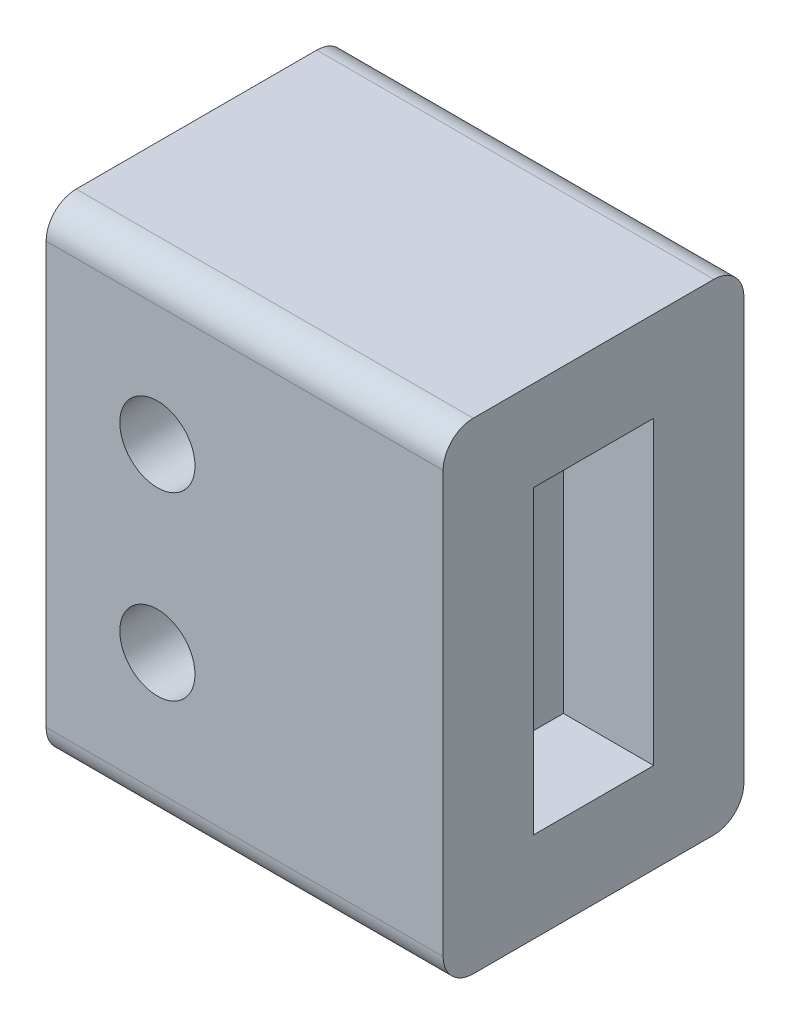
ISO-10303-21;
HEADER;
FILE_DESCRIPTION(('STEP AP214'),'2;1');
FILE_NAME('part.step','',(''),(''),'','','');
FILE_SCHEMA(('AUTOMOTIVE_DESIGN { 1 0 10303 214 1 1 1 1 }'));
ENDSEC;
DATA;
#1=APPLICATION_CONTEXT('core data for automotive mechanical design processes');
#2=APPLICATION_PROTOCOL_DEFINITION('international standard','automotive_design',2000,#1);
#3=PRODUCT_CONTEXT('',#1,'mechanical');
#4=PRODUCT('Part','Part','',(#3));
#5=PRODUCT_RELATED_PRODUCT_CATEGORY('part','',(#4));
#6=PRODUCT_DEFINITION_FORMATION('','',#4);
#7=PRODUCT_DEFINITION_CONTEXT('part definition',#1,'design');
#8=PRODUCT_DEFINITION('design','',#6,#7);
#9=PRODUCT_DEFINITION_SHAPE('','',#8);
#10=(LENGTH_UNIT() NAMED_UNIT(*) SI_UNIT(.MILLI.,.METRE.));
#11=(NAMED_UNIT(*) PLANE_ANGLE_UNIT() SI_UNIT($,.RADIAN.));
#12=(NAMED_UNIT(*) SI_UNIT($,.STERADIAN.) SOLID_ANGLE_UNIT());
#13=UNCERTAINTY_MEASURE_WITH_UNIT(LENGTH_MEASURE(1.E-05),#10,'distance_accuracy_value','');
#14=(GEOMETRIC_REPRESENTATION_CONTEXT(3) GLOBAL_UNCERTAINTY_ASSIGNED_CONTEXT((#13)) GLOBAL_UNIT_ASSIGNED_CONTEXT((#10,
#11,#12)) REPRESENTATION_CONTEXT('',''));
#15=CARTESIAN_POINT('',(0.,0.,0.));
#16=DIRECTION('',(0.,0.,1.));
#17=DIRECTION('',(1.,0.,0.));
#18=AXIS2_PLACEMENT_3D('',#15,#16,#17);
#19=CARTESIAN_POINT('',(16.3,6.,6.));
#20=DIRECTION('',(1.,0.,0.));
#21=DIRECTION('',(0.,0.,-1.));
#22=AXIS2_PLACEMENT_3D('',#19,#20,#21);
#23=PLANE('',#22);
#24=DIRECTION('',(0.,-1.,0.));
#25=VECTOR('',#24,1.);
#26=CARTESIAN_POINT('',(16.3,6.,-2.));
#27=LINE('',#26,#25);
#28=CARTESIAN_POINT('',(16.3,7.,-2.));
#29=VERTEX_POINT('',#28);
#30=CARTESIAN_POINT('',(16.3,-7.,-2.));
#31=VERTEX_POINT('',#30);
#32=EDGE_CURVE('E255',#29,#31,#27,.T.);
#33=ORIENTED_EDGE('',*,*,#32,.T.);
#34=CARTESIAN_POINT('',(16.3,-7.,-1.));
#35=DIRECTION('',(1.,0.,0.));
#36=DIRECTION('',(0.,0.,-1.));
#37=AXIS2_PLACEMENT_3D('',#34,#35,#36);
#38=CIRCLE('',#37,1.);
#39=CARTESIAN_POINT('',(16.3,-8.,-1.));
#40=VERTEX_POINT('',#39);
#41=EDGE_CURVE('E291',#31,#40,#38,.F.);
#42=ORIENTED_EDGE('',*,*,#41,.T.);
#43=DIRECTION('',(0.,0.,-1.));
#44=VECTOR('',#43,1.);
#45=CARTESIAN_POINT('',(16.3,-8.,6.));
#46=LINE('',#45,#44);
#47=CARTESIAN_POINT('',(16.3,-8.,7.));
#48=VERTEX_POINT('',#47);
#49=EDGE_CURVE('E259',#48,#40,#46,.T.);
#50=ORIENTED_EDGE('',*,*,#49,.F.);
#51=CARTESIAN_POINT('',(16.3,-7.,7.));
#52=DIRECTION('',(1.,0.,0.));
#53=DIRECTION('',(0.,0.,-1.));
#54=AXIS2_PLACEMENT_3D('',#51,#52,#53);
#55=CIRCLE('',#54,1.);
#56=CARTESIAN_POINT('',(16.3,-7.,8.));
#57=VERTEX_POINT('',#56);
#58=EDGE_CURVE('E289',#48,#57,#55,.F.);
#59=ORIENTED_EDGE('',*,*,#58,.T.);
#60=DIRECTION('',(0.,-1.,0.));
#61=VECTOR('',#60,1.);
#62=CARTESIAN_POINT('',(16.3,6.,8.));
#63=LINE('',#62,#61);
#64=CARTESIAN_POINT('',(16.3,7.,8.));
#65=VERTEX_POINT('',#64);
#66=EDGE_CURVE('E262',#65,#57,#63,.T.);
#67=ORIENTED_EDGE('',*,*,#66,.F.);
#68=CARTESIAN_POINT('',(16.3,7.,7.));
#69=DIRECTION('',(1.,0.,0.));
#70=DIRECTION('',(0.,0.,-1.));
#71=AXIS2_PLACEMENT_3D('',#68,#69,#70);
#72=CIRCLE('',#71,1.);
#73=CARTESIAN_POINT('',(16.3,8.,7.));
#74=VERTEX_POINT('',#73);
#75=EDGE_CURVE('E59',#65,#74,#72,.F.);
#76=ORIENTED_EDGE('',*,*,#75,.T.);
#77=DIRECTION('',(0.,0.,-1.));
#78=VECTOR('',#77,1.);
#79=CARTESIAN_POINT('',(16.3,8.,6.));
#80=LINE('',#79,#78);
#81=CARTESIAN_POINT('',(16.3,8.,-1.));
#82=VERTEX_POINT('',#81);
#83=EDGE_CURVE('E256',#74,#82,#80,.T.);
#84=ORIENTED_EDGE('',*,*,#83,.T.);
#85=CARTESIAN_POINT('',(16.3,7.,-1.));
#86=DIRECTION('',(1.,0.,0.));
#87=DIRECTION('',(0.,0.,-1.));
#88=AXIS2_PLACEMENT_3D('',#85,#86,#87);
#89=CIRCLE('',#88,1.);
#90=EDGE_CURVE('E51',#82,#29,#89,.F.);
#91=ORIENTED_EDGE('',*,*,#90,.T.);
#92=EDGE_LOOP('',(#33,#42,#50,#59,#67,#76,#84,#91));
#93=FACE_BOUND('',#92,.T.);
#94=DIRECTION('',(0.,-1.,0.));
#95=VECTOR('',#94,1.);
#96=CARTESIAN_POINT('',(16.3,6.,0.));
#97=LINE('',#96,#95);
#98=CARTESIAN_POINT('',(16.3,6.,0.));
#99=VERTEX_POINT('',#98);
#100=CARTESIAN_POINT('',(16.3,-6.,0.));
#101=VERTEX_POINT('',#100);
#102=EDGE_CURVE('E241',#99,#101,#97,.T.);
#103=ORIENTED_EDGE('',*,*,#102,.F.);
#104=DIRECTION('',(0.,0.,-1.));
#105=VECTOR('',#104,1.);
#106=CARTESIAN_POINT('',(16.3,6.,6.));
#107=LINE('',#106,#105);
#108=CARTESIAN_POINT('',(16.3,6.,6.));
#109=VERTEX_POINT('',#108);
#110=EDGE_CURVE('E249',#109,#99,#107,.T.);
#111=ORIENTED_EDGE('',*,*,#110,.F.);
#112=DIRECTION('',(0.,-1.,0.));
#113=VECTOR('',#112,1.);
#114=CARTESIAN_POINT('',(16.3,6.,6.));
#115=LINE('',#114,#113);
#116=CARTESIAN_POINT('',(16.3,-6.,6.));
#117=VERTEX_POINT('',#116);
#118=EDGE_CURVE('E231',#109,#117,#115,.T.);
#119=ORIENTED_EDGE('',*,*,#118,.T.);
#120=DIRECTION('',(0.,0.,-1.));
#121=VECTOR('',#120,1.);
#122=CARTESIAN_POINT('',(16.3,-6.,6.));
#123=LINE('',#122,#121);
#124=EDGE_CURVE('E246',#117,#101,#123,.T.);
#125=ORIENTED_EDGE('',*,*,#124,.T.);
#126=EDGE_LOOP('',(#103,#111,#119,#125));
#127=FACE_BOUND('',#126,.T.);
#128=ADVANCED_FACE('F36',(#93,#127),#23,.F.);
#129=CARTESIAN_POINT('',(23.5,8.,6.));
#130=DIRECTION('',(0.,-1.,0.));
#131=DIRECTION('',(1.,0.,0.));
#132=AXIS2_PLACEMENT_3D('',#129,#130,#131);
#133=PLANE('',#132);
#134=ORIENTED_EDGE('',*,*,#83,.F.);
#135=DIRECTION('',(-1.,0.,0.));
#136=VECTOR('',#135,1.);
#137=CARTESIAN_POINT('',(29.5,8.,7.));
#138=LINE('',#137,#136);
#139=CARTESIAN_POINT('',(29.5,8.,7.));
#140=VERTEX_POINT('',#139);
#141=EDGE_CURVE('E11',#74,#140,#138,.F.);
#142=ORIENTED_EDGE('',*,*,#141,.T.);
#143=DIRECTION('',(0.,0.,1.));
#144=VECTOR('',#143,1.);
#145=CARTESIAN_POINT('',(29.5,8.,8.));
#146=LINE('',#145,#144);
#147=CARTESIAN_POINT('',(29.5,8.,-1.));
#148=VERTEX_POINT('',#147);
#149=EDGE_CURVE('E200',#148,#140,#146,.T.);
#150=ORIENTED_EDGE('',*,*,#149,.F.);
#151=DIRECTION('',(-1.,0.,0.));
#152=VECTOR('',#151,1.);
#153=CARTESIAN_POINT('',(23.5,8.,-1.));
#154=LINE('',#153,#152);
#155=EDGE_CURVE('E44',#148,#82,#154,.T.);
#156=ORIENTED_EDGE('',*,*,#155,.T.);
#157=EDGE_LOOP('',(#134,#142,#150,#156));
#158=FACE_BOUND('',#157,.T.);
#159=ADVANCED_FACE('F300',(#158),#133,.F.);
#160=CARTESIAN_POINT('',(16.3,-8.,6.));
#161=DIRECTION('',(0.,1.,0.));
#162=DIRECTION('',(-1.,0.,0.));
#163=AXIS2_PLACEMENT_3D('',#160,#161,#162);
#164=PLANE('',#163);
#165=ORIENTED_EDGE('',*,*,#49,.T.);
#166=DIRECTION('',(1.,0.,0.));
#167=VECTOR('',#166,1.);
#168=CARTESIAN_POINT('',(16.3,-8.,-1.));
#169=LINE('',#168,#167);
#170=CARTESIAN_POINT('',(29.5,-8.,-1.));
#171=VERTEX_POINT('',#170);
#172=EDGE_CURVE('E272',#40,#171,#169,.T.);
#173=ORIENTED_EDGE('',*,*,#172,.T.);
#174=DIRECTION('',(0.,0.,-1.));
#175=VECTOR('',#174,1.);
#176=CARTESIAN_POINT('',(29.5,-8.,8.));
#177=LINE('',#176,#175);
#178=CARTESIAN_POINT('',(29.5,-8.,7.));
#179=VERTEX_POINT('',#178);
#180=EDGE_CURVE('E194',#179,#171,#177,.T.);
#181=ORIENTED_EDGE('',*,*,#180,.F.);
#182=DIRECTION('',(1.,0.,0.));
#183=VECTOR('',#182,1.);
#184=CARTESIAN_POINT('',(16.3,-8.,7.));
#185=LINE('',#184,#183);
#186=EDGE_CURVE('E258',#179,#48,#185,.F.);
#187=ORIENTED_EDGE('',*,*,#186,.T.);
#188=EDGE_LOOP('',(#165,#173,#181,#187));
#189=FACE_BOUND('',#188,.T.);
#190=ADVANCED_FACE('F317',(#189),#164,.F.);
#191=CARTESIAN_POINT('',(0.,0.,8.));
#192=DIRECTION('',(0.,0.,1.));
#193=DIRECTION('',(1.,0.,0.));
#194=AXIS2_PLACEMENT_3D('',#191,#192,#193);
#195=PLANE('',#194);
#196=CARTESIAN_POINT('',(20.,-3.,8.));
#197=DIRECTION('',(0.,0.,1.));
#198=DIRECTION('',(1.,0.,0.));
#199=AXIS2_PLACEMENT_3D('',#196,#197,#198);
#200=CIRCLE('',#199,1.25);
#201=CARTESIAN_POINT('',(21.25,-3.,8.));
#202=VERTEX_POINT('',#201);
#203=EDGE_CURVE('E204',#202,#202,#200,.T.);
#204=ORIENTED_EDGE('',*,*,#203,.F.);
#205=EDGE_LOOP('',(#204));
#206=FACE_BOUND('',#205,.T.);
#207=CARTESIAN_POINT('',(20.,3.,8.));
#208=DIRECTION('',(0.,0.,1.));
#209=DIRECTION('',(1.,0.,0.));
#210=AXIS2_PLACEMENT_3D('',#207,#208,#209);
#211=CIRCLE('',#210,1.25);
#212=CARTESIAN_POINT('',(21.25,3.,8.));
#213=VERTEX_POINT('',#212);
#214=EDGE_CURVE('E203',#213,#213,#211,.T.);
#215=ORIENTED_EDGE('',*,*,#214,.F.);
#216=EDGE_LOOP('',(#215));
#217=FACE_BOUND('',#216,.T.);
#218=ORIENTED_EDGE('',*,*,#66,.T.);
#219=DIRECTION('',(1.,0.,0.));
#220=VECTOR('',#219,1.);
#221=CARTESIAN_POINT('',(29.5,-7.,8.));
#222=LINE('',#221,#220);
#223=CARTESIAN_POINT('',(29.5,-7.,8.));
#224=VERTEX_POINT('',#223);
#225=EDGE_CURVE('E296',#57,#224,#222,.T.);
#226=ORIENTED_EDGE('',*,*,#225,.T.);
#227=DIRECTION('',(0.,-1.,0.));
#228=VECTOR('',#227,1.);
#229=CARTESIAN_POINT('',(29.5,8.,8.));
#230=LINE('',#229,#228);
#231=CARTESIAN_POINT('',(29.5,7.,8.));
#232=VERTEX_POINT('',#231);
#233=EDGE_CURVE('E191',#232,#224,#230,.T.);
#234=ORIENTED_EDGE('',*,*,#233,.F.);
#235=DIRECTION('',(-1.,0.,0.));
#236=VECTOR('',#235,1.);
#237=CARTESIAN_POINT('',(16.3,7.,8.));
#238=LINE('',#237,#236);
#239=EDGE_CURVE('E293',#232,#65,#238,.T.);
#240=ORIENTED_EDGE('',*,*,#239,.T.);
#241=EDGE_LOOP('',(#218,#226,#234,#240));
#242=FACE_BOUND('',#241,.T.);
#243=ADVANCED_FACE('F324',(#206,#217,#242),#195,.T.);
#244=CARTESIAN_POINT('',(0.,0.,-2.));
#245=DIRECTION('',(0.,0.,1.));
#246=DIRECTION('',(1.,0.,0.));
#247=AXIS2_PLACEMENT_3D('',#244,#245,#246);
#248=PLANE('',#247);
#249=CARTESIAN_POINT('',(20.,-3.,-2.));
#250=DIRECTION('',(0.,0.,1.));
#251=DIRECTION('',(1.,0.,0.));
#252=AXIS2_PLACEMENT_3D('',#249,#250,#251);
#253=CIRCLE('',#252,1.25);
#254=CARTESIAN_POINT('',(21.25,-3.,-2.));
#255=VERTEX_POINT('',#254);
#256=EDGE_CURVE('E207',#255,#255,#253,.T.);
#257=ORIENTED_EDGE('',*,*,#256,.T.);
#258=EDGE_LOOP('',(#257));
#259=FACE_BOUND('',#258,.T.);
#260=CARTESIAN_POINT('',(20.,3.,-2.));
#261=DIRECTION('',(0.,0.,1.));
#262=DIRECTION('',(1.,0.,0.));
#263=AXIS2_PLACEMENT_3D('',#260,#261,#262);
#264=CIRCLE('',#263,1.25);
#265=CARTESIAN_POINT('',(21.25,3.,-2.));
#266=VERTEX_POINT('',#265);
#267=EDGE_CURVE('E208',#266,#266,#264,.T.);
#268=ORIENTED_EDGE('',*,*,#267,.T.);
#269=EDGE_LOOP('',(#268));
#270=FACE_BOUND('',#269,.T.);
#271=DIRECTION('',(0.,1.,0.));
#272=VECTOR('',#271,1.);
#273=CARTESIAN_POINT('',(29.5,8.,-2.));
#274=LINE('',#273,#272);
#275=CARTESIAN_POINT('',(29.5,-7.,-2.));
#276=VERTEX_POINT('',#275);
#277=CARTESIAN_POINT('',(29.5,7.,-2.));
#278=VERTEX_POINT('',#277);
#279=EDGE_CURVE('E197',#276,#278,#274,.T.);
#280=ORIENTED_EDGE('',*,*,#279,.F.);
#281=DIRECTION('',(1.,0.,0.));
#282=VECTOR('',#281,1.);
#283=CARTESIAN_POINT('',(0.,-7.,-2.));
#284=LINE('',#283,#282);
#285=EDGE_CURVE('E285',#276,#31,#284,.F.);
#286=ORIENTED_EDGE('',*,*,#285,.T.);
#287=ORIENTED_EDGE('',*,*,#32,.F.);
#288=DIRECTION('',(-1.,0.,0.));
#289=VECTOR('',#288,1.);
#290=CARTESIAN_POINT('',(0.,7.,-2.));
#291=LINE('',#290,#289);
#292=EDGE_CURVE('E283',#29,#278,#291,.F.);
#293=ORIENTED_EDGE('',*,*,#292,.T.);
#294=EDGE_LOOP('',(#280,#286,#287,#293));
#295=FACE_BOUND('',#294,.T.);
#296=ADVANCED_FACE('F308',(#259,#270,#295),#248,.F.);
#297=CARTESIAN_POINT('',(23.5,-6.,6.));
#298=DIRECTION('',(-1.,0.,0.));
#299=DIRECTION('',(0.,0.,1.));
#300=AXIS2_PLACEMENT_3D('',#297,#298,#299);
#301=PLANE('',#300);
#302=DIRECTION('',(0.,1.,0.));
#303=VECTOR('',#302,1.);
#304=CARTESIAN_POINT('',(23.5,-6.,0.));
#305=LINE('',#304,#303);
#306=CARTESIAN_POINT('',(23.5,-6.,0.));
#307=VERTEX_POINT('',#306);
#308=CARTESIAN_POINT('',(23.5,6.,0.));
#309=VERTEX_POINT('',#308);
#310=EDGE_CURVE('E223',#307,#309,#305,.T.);
#311=ORIENTED_EDGE('',*,*,#310,.F.);
#312=DIRECTION('',(0.,0.,-1.));
#313=VECTOR('',#312,1.);
#314=CARTESIAN_POINT('',(23.5,-6.,6.));
#315=LINE('',#314,#313);
#316=CARTESIAN_POINT('',(23.5,-6.,6.));
#317=VERTEX_POINT('',#316);
#318=EDGE_CURVE('E236',#317,#307,#315,.T.);
#319=ORIENTED_EDGE('',*,*,#318,.F.);
#320=DIRECTION('',(0.,1.,0.));
#321=VECTOR('',#320,1.);
#322=CARTESIAN_POINT('',(23.5,-6.,6.));
#323=LINE('',#322,#321);
#324=CARTESIAN_POINT('',(23.5,6.,6.));
#325=VERTEX_POINT('',#324);
#326=EDGE_CURVE('E224',#317,#325,#323,.T.);
#327=ORIENTED_EDGE('',*,*,#326,.T.);
#328=DIRECTION('',(0.,0.,-1.));
#329=VECTOR('',#328,1.);
#330=CARTESIAN_POINT('',(23.5,6.,6.));
#331=LINE('',#330,#329);
#332=EDGE_CURVE('E252',#325,#309,#331,.T.);
#333=ORIENTED_EDGE('',*,*,#332,.T.);
#334=EDGE_LOOP('',(#311,#319,#327,#333));
#335=FACE_BOUND('',#334,.T.);
#336=ADVANCED_FACE('F342',(#335),#301,.T.);
#337=CARTESIAN_POINT('',(23.5,6.,6.));
#338=DIRECTION('',(0.,-1.,0.));
#339=DIRECTION('',(1.,0.,0.));
#340=AXIS2_PLACEMENT_3D('',#337,#338,#339);
#341=PLANE('',#340);
#342=DIRECTION('',(-1.,0.,0.));
#343=VECTOR('',#342,1.);
#344=CARTESIAN_POINT('',(23.5,6.,0.));
#345=LINE('',#344,#343);
#346=EDGE_CURVE('E239',#309,#99,#345,.T.);
#347=ORIENTED_EDGE('',*,*,#346,.F.);
#348=ORIENTED_EDGE('',*,*,#332,.F.);
#349=DIRECTION('',(-1.,0.,0.));
#350=VECTOR('',#349,1.);
#351=CARTESIAN_POINT('',(23.5,6.,6.));
#352=LINE('',#351,#350);
#353=EDGE_CURVE('E227',#325,#109,#352,.T.);
#354=ORIENTED_EDGE('',*,*,#353,.T.);
#355=ORIENTED_EDGE('',*,*,#110,.T.);
#356=EDGE_LOOP('',(#347,#348,#354,#355));
#357=FACE_BOUND('',#356,.T.);
#358=ADVANCED_FACE('F390',(#357),#341,.T.);
#359=CARTESIAN_POINT('',(16.3,-6.,6.));
#360=DIRECTION('',(0.,1.,0.));
#361=DIRECTION('',(-1.,0.,0.));
#362=AXIS2_PLACEMENT_3D('',#359,#360,#361);
#363=PLANE('',#362);
#364=DIRECTION('',(1.,0.,0.));
#365=VECTOR('',#364,1.);
#366=CARTESIAN_POINT('',(16.3,-6.,0.));
#367=LINE('',#366,#365);
#368=EDGE_CURVE('E228',#101,#307,#367,.T.);
#369=ORIENTED_EDGE('',*,*,#368,.F.);
#370=ORIENTED_EDGE('',*,*,#124,.F.);
#371=DIRECTION('',(1.,0.,0.));
#372=VECTOR('',#371,1.);
#373=CARTESIAN_POINT('',(16.3,-6.,6.));
#374=LINE('',#373,#372);
#375=EDGE_CURVE('E234',#117,#317,#374,.T.);
#376=ORIENTED_EDGE('',*,*,#375,.T.);
#377=ORIENTED_EDGE('',*,*,#318,.T.);
#378=EDGE_LOOP('',(#369,#370,#376,#377));
#379=FACE_BOUND('',#378,.T.);
#380=ADVANCED_FACE('F384',(#379),#363,.T.);
#381=CARTESIAN_POINT('',(0.,0.,6.));
#382=DIRECTION('',(0.,0.,1.));
#383=DIRECTION('',(1.,0.,0.));
#384=AXIS2_PLACEMENT_3D('',#381,#382,#383);
#385=PLANE('',#384);
#386=CARTESIAN_POINT('',(20.,-3.,6.));
#387=DIRECTION('',(0.,0.,1.));
#388=DIRECTION('',(1.,0.,0.));
#389=AXIS2_PLACEMENT_3D('',#386,#387,#388);
#390=CIRCLE('',#389,1.25);
#391=CARTESIAN_POINT('',(21.25,-3.,6.));
#392=VERTEX_POINT('',#391);
#393=EDGE_CURVE('E220',#392,#392,#390,.T.);
#394=ORIENTED_EDGE('',*,*,#393,.T.);
#395=EDGE_LOOP('',(#394));
#396=FACE_BOUND('',#395,.T.);
#397=CARTESIAN_POINT('',(20.,3.,6.));
#398=DIRECTION('',(0.,0.,1.));
#399=DIRECTION('',(1.,0.,0.));
#400=AXIS2_PLACEMENT_3D('',#397,#398,#399);
#401=CIRCLE('',#400,1.25);
#402=CARTESIAN_POINT('',(21.25,3.,6.));
#403=VERTEX_POINT('',#402);
#404=EDGE_CURVE('E216',#403,#403,#401,.T.);
#405=ORIENTED_EDGE('',*,*,#404,.T.);
#406=EDGE_LOOP('',(#405));
#407=FACE_BOUND('',#406,.T.);
#408=ORIENTED_EDGE('',*,*,#326,.F.);
#409=ORIENTED_EDGE('',*,*,#375,.F.);
#410=ORIENTED_EDGE('',*,*,#118,.F.);
#411=ORIENTED_EDGE('',*,*,#353,.F.);
#412=EDGE_LOOP('',(#408,#409,#410,#411));
#413=FACE_BOUND('',#412,.T.);
#414=ADVANCED_FACE('F381',(#396,#407,#413),#385,.F.);
#415=CARTESIAN_POINT('',(0.,0.,0.));
#416=DIRECTION('',(0.,0.,1.));
#417=DIRECTION('',(1.,0.,0.));
#418=AXIS2_PLACEMENT_3D('',#415,#416,#417);
#419=PLANE('',#418);
#420=CARTESIAN_POINT('',(20.,-3.,0.));
#421=DIRECTION('',(0.,0.,1.));
#422=DIRECTION('',(1.,0.,0.));
#423=AXIS2_PLACEMENT_3D('',#420,#421,#422);
#424=CIRCLE('',#423,1.25);
#425=CARTESIAN_POINT('',(21.25,-3.,0.));
#426=VERTEX_POINT('',#425);
#427=EDGE_CURVE('E219',#426,#426,#424,.T.);
#428=ORIENTED_EDGE('',*,*,#427,.F.);
#429=EDGE_LOOP('',(#428));
#430=FACE_BOUND('',#429,.T.);
#431=CARTESIAN_POINT('',(20.,3.,0.));
#432=DIRECTION('',(0.,0.,1.));
#433=DIRECTION('',(1.,0.,0.));
#434=AXIS2_PLACEMENT_3D('',#431,#432,#433);
#435=CIRCLE('',#434,1.25);
#436=CARTESIAN_POINT('',(21.25,3.,0.));
#437=VERTEX_POINT('',#436);
#438=EDGE_CURVE('E211',#437,#437,#435,.T.);
#439=ORIENTED_EDGE('',*,*,#438,.F.);
#440=EDGE_LOOP('',(#439));
#441=FACE_BOUND('',#440,.T.);
#442=ORIENTED_EDGE('',*,*,#310,.T.);
#443=ORIENTED_EDGE('',*,*,#346,.T.);
#444=ORIENTED_EDGE('',*,*,#102,.T.);
#445=ORIENTED_EDGE('',*,*,#368,.T.);
#446=EDGE_LOOP('',(#442,#443,#444,#445));
#447=FACE_BOUND('',#446,.T.);
#448=ADVANCED_FACE('F379',(#430,#441,#447),#419,.T.);
#449=CARTESIAN_POINT('',(20.,3.,-2.));
#450=DIRECTION('',(0.,0.,1.));
#451=DIRECTION('',(1.,0.,0.));
#452=AXIS2_PLACEMENT_3D('',#449,#450,#451);
#453=CYLINDRICAL_SURFACE('',#452,1.25);
#454=ORIENTED_EDGE('',*,*,#438,.T.);
#455=EDGE_LOOP('',(#454));
#456=FACE_BOUND('',#455,.T.);
#457=ORIENTED_EDGE('',*,*,#267,.F.);
#458=EDGE_LOOP('',(#457));
#459=FACE_BOUND('',#458,.T.);
#460=ADVANCED_FACE('F375',(#456,#459),#453,.F.);
#461=CARTESIAN_POINT('',(20.,-3.,-2.));
#462=DIRECTION('',(0.,0.,1.));
#463=DIRECTION('',(1.,0.,0.));
#464=AXIS2_PLACEMENT_3D('',#461,#462,#463);
#465=CYLINDRICAL_SURFACE('',#464,1.25);
#466=ORIENTED_EDGE('',*,*,#427,.T.);
#467=EDGE_LOOP('',(#466));
#468=FACE_BOUND('',#467,.T.);
#469=ORIENTED_EDGE('',*,*,#256,.F.);
#470=EDGE_LOOP('',(#469));
#471=FACE_BOUND('',#470,.T.);
#472=ADVANCED_FACE('F371',(#468,#471),#465,.F.);
#473=ORIENTED_EDGE('',*,*,#214,.T.);
#474=EDGE_LOOP('',(#473));
#475=FACE_BOUND('',#474,.T.);
#476=ORIENTED_EDGE('',*,*,#404,.F.);
#477=EDGE_LOOP('',(#476));
#478=FACE_BOUND('',#477,.T.);
#479=ADVANCED_FACE('F374',(#475,#478),#453,.F.);
#480=ORIENTED_EDGE('',*,*,#203,.T.);
#481=EDGE_LOOP('',(#480));
#482=FACE_BOUND('',#481,.T.);
#483=ORIENTED_EDGE('',*,*,#393,.F.);
#484=EDGE_LOOP('',(#483));
#485=FACE_BOUND('',#484,.T.);
#486=ADVANCED_FACE('F370',(#482,#485),#465,.F.);
#487=CARTESIAN_POINT('',(29.5,0.,0.));
#488=DIRECTION('',(1.,0.,0.));
#489=DIRECTION('',(0.,0.,-1.));
#490=AXIS2_PLACEMENT_3D('',#487,#488,#489);
#491=PLANE('',#490);
#492=DIRECTION('',(0.,-1.,0.));
#493=VECTOR('',#492,1.);
#494=CARTESIAN_POINT('',(29.5,0.,5.));
#495=LINE('',#494,#493);
#496=CARTESIAN_POINT('',(29.5,5.,5.));
#497=VERTEX_POINT('',#496);
#498=CARTESIAN_POINT('',(29.5,-5.,5.));
#499=VERTEX_POINT('',#498);
#500=EDGE_CURVE('E155',#497,#499,#495,.T.);
#501=ORIENTED_EDGE('',*,*,#500,.F.);
#502=DIRECTION('',(0.,0.,1.));
#503=VECTOR('',#502,1.);
#504=CARTESIAN_POINT('',(29.5,5.,6.));
#505=LINE('',#504,#503);
#506=CARTESIAN_POINT('',(29.5,5.,1.));
#507=VERTEX_POINT('',#506);
#508=EDGE_CURVE('E166',#507,#497,#505,.T.);
#509=ORIENTED_EDGE('',*,*,#508,.F.);
#510=DIRECTION('',(0.,1.,0.));
#511=VECTOR('',#510,1.);
#512=CARTESIAN_POINT('',(29.5,0.,1.));
#513=LINE('',#512,#511);
#514=CARTESIAN_POINT('',(29.5,-5.,1.));
#515=VERTEX_POINT('',#514);
#516=EDGE_CURVE('E172',#515,#507,#513,.T.);
#517=ORIENTED_EDGE('',*,*,#516,.F.);
#518=DIRECTION('',(0.,0.,-1.));
#519=VECTOR('',#518,1.);
#520=CARTESIAN_POINT('',(29.5,-5.,6.));
#521=LINE('',#520,#519);
#522=EDGE_CURVE('E177',#499,#515,#521,.T.);
#523=ORIENTED_EDGE('',*,*,#522,.F.);
#524=EDGE_LOOP('',(#501,#509,#517,#523));
#525=FACE_BOUND('',#524,.T.);
#526=ORIENTED_EDGE('',*,*,#180,.T.);
#527=CARTESIAN_POINT('',(29.5,-7.,-1.));
#528=DIRECTION('',(1.,0.,0.));
#529=DIRECTION('',(0.,0.,-1.));
#530=AXIS2_PLACEMENT_3D('',#527,#528,#529);
#531=CIRCLE('',#530,1.);
#532=EDGE_CURVE('E281',#171,#276,#531,.T.);
#533=ORIENTED_EDGE('',*,*,#532,.T.);
#534=ORIENTED_EDGE('',*,*,#279,.T.);
#535=CARTESIAN_POINT('',(29.5,7.,-1.));
#536=DIRECTION('',(1.,0.,0.));
#537=DIRECTION('',(0.,0.,-1.));
#538=AXIS2_PLACEMENT_3D('',#535,#536,#537);
#539=CIRCLE('',#538,1.);
#540=EDGE_CURVE('E275',#278,#148,#539,.T.);
#541=ORIENTED_EDGE('',*,*,#540,.T.);
#542=ORIENTED_EDGE('',*,*,#149,.T.);
#543=CARTESIAN_POINT('',(29.5,7.,7.));
#544=DIRECTION('',(1.,0.,0.));
#545=DIRECTION('',(0.,0.,-1.));
#546=AXIS2_PLACEMENT_3D('',#543,#544,#545);
#547=CIRCLE('',#546,1.);
#548=EDGE_CURVE('E277',#140,#232,#547,.T.);
#549=ORIENTED_EDGE('',*,*,#548,.T.);
#550=ORIENTED_EDGE('',*,*,#233,.T.);
#551=CARTESIAN_POINT('',(29.5,-7.,7.));
#552=DIRECTION('',(1.,0.,0.));
#553=DIRECTION('',(0.,0.,-1.));
#554=AXIS2_PLACEMENT_3D('',#551,#552,#553);
#555=CIRCLE('',#554,1.);
#556=EDGE_CURVE('E279',#224,#179,#555,.T.);
#557=ORIENTED_EDGE('',*,*,#556,.T.);
#558=EDGE_LOOP('',(#526,#533,#534,#541,#542,#549,#550,#557));
#559=FACE_BOUND('',#558,.T.);
#560=ADVANCED_FACE('F174',(#525,#559),#491,.T.);
#561=CARTESIAN_POINT('',(23.5,5.,6.));
#562=DIRECTION('',(0.,-1.,0.));
#563=DIRECTION('',(1.,0.,0.));
#564=AXIS2_PLACEMENT_3D('',#561,#562,#563);
#565=PLANE('',#564);
#566=DIRECTION('',(0.,0.,-1.));
#567=VECTOR('',#566,1.);
#568=CARTESIAN_POINT('',(26.5,5.,6.));
#569=LINE('',#568,#567);
#570=CARTESIAN_POINT('',(26.5,5.,5.));
#571=VERTEX_POINT('',#570);
#572=CARTESIAN_POINT('',(26.5,5.,1.));
#573=VERTEX_POINT('',#572);
#574=EDGE_CURVE('E186',#571,#573,#569,.T.);
#575=ORIENTED_EDGE('',*,*,#574,.T.);
#576=DIRECTION('',(-1.,0.,0.));
#577=VECTOR('',#576,1.);
#578=CARTESIAN_POINT('',(23.5,5.,1.));
#579=LINE('',#578,#577);
#580=EDGE_CURVE('E169',#507,#573,#579,.T.);
#581=ORIENTED_EDGE('',*,*,#580,.F.);
#582=ORIENTED_EDGE('',*,*,#508,.T.);
#583=DIRECTION('',(-1.,0.,0.));
#584=VECTOR('',#583,1.);
#585=CARTESIAN_POINT('',(23.5,5.,5.));
#586=LINE('',#585,#584);
#587=EDGE_CURVE('E150',#497,#571,#586,.T.);
#588=ORIENTED_EDGE('',*,*,#587,.T.);
#589=EDGE_LOOP('',(#575,#581,#582,#588));
#590=FACE_BOUND('',#589,.T.);
#591=ADVANCED_FACE('F167',(#590),#565,.T.);
#592=CARTESIAN_POINT('',(16.3,-5.,6.));
#593=DIRECTION('',(0.,1.,0.));
#594=DIRECTION('',(-1.,0.,0.));
#595=AXIS2_PLACEMENT_3D('',#592,#593,#594);
#596=PLANE('',#595);
#597=DIRECTION('',(0.,0.,1.));
#598=VECTOR('',#597,1.);
#599=CARTESIAN_POINT('',(26.5,-5.,6.));
#600=LINE('',#599,#598);
#601=CARTESIAN_POINT('',(26.5,-5.,1.));
#602=VERTEX_POINT('',#601);
#603=CARTESIAN_POINT('',(26.5,-5.,5.));
#604=VERTEX_POINT('',#603);
#605=EDGE_CURVE('E183',#602,#604,#600,.T.);
#606=ORIENTED_EDGE('',*,*,#605,.T.);
#607=DIRECTION('',(1.,0.,0.));
#608=VECTOR('',#607,1.);
#609=CARTESIAN_POINT('',(16.3,-5.,5.));
#610=LINE('',#609,#608);
#611=EDGE_CURVE('E161',#604,#499,#610,.T.);
#612=ORIENTED_EDGE('',*,*,#611,.T.);
#613=ORIENTED_EDGE('',*,*,#522,.T.);
#614=DIRECTION('',(1.,0.,0.));
#615=VECTOR('',#614,1.);
#616=CARTESIAN_POINT('',(16.3,-5.,1.));
#617=LINE('',#616,#615);
#618=EDGE_CURVE('E162',#602,#515,#617,.T.);
#619=ORIENTED_EDGE('',*,*,#618,.F.);
#620=EDGE_LOOP('',(#606,#612,#613,#619));
#621=FACE_BOUND('',#620,.T.);
#622=ADVANCED_FACE('F454',(#621),#596,.T.);
#623=CARTESIAN_POINT('',(0.,0.,5.));
#624=DIRECTION('',(0.,0.,1.));
#625=DIRECTION('',(1.,0.,0.));
#626=AXIS2_PLACEMENT_3D('',#623,#624,#625);
#627=PLANE('',#626);
#628=ORIENTED_EDGE('',*,*,#587,.F.);
#629=ORIENTED_EDGE('',*,*,#500,.T.);
#630=ORIENTED_EDGE('',*,*,#611,.F.);
#631=DIRECTION('',(0.,-1.,0.));
#632=VECTOR('',#631,1.);
#633=CARTESIAN_POINT('',(26.5,0.,5.));
#634=LINE('',#633,#632);
#635=EDGE_CURVE('E157',#571,#604,#634,.T.);
#636=ORIENTED_EDGE('',*,*,#635,.F.);
#637=EDGE_LOOP('',(#628,#629,#630,#636));
#638=FACE_BOUND('',#637,.T.);
#639=ADVANCED_FACE('F152',(#638),#627,.F.);
#640=CARTESIAN_POINT('',(0.,0.,1.));
#641=DIRECTION('',(0.,0.,1.));
#642=DIRECTION('',(1.,0.,0.));
#643=AXIS2_PLACEMENT_3D('',#640,#641,#642);
#644=PLANE('',#643);
#645=DIRECTION('',(0.,-1.,0.));
#646=VECTOR('',#645,1.);
#647=CARTESIAN_POINT('',(26.5,0.,1.));
#648=LINE('',#647,#646);
#649=EDGE_CURVE('E188',#573,#602,#648,.T.);
#650=ORIENTED_EDGE('',*,*,#649,.T.);
#651=ORIENTED_EDGE('',*,*,#618,.T.);
#652=ORIENTED_EDGE('',*,*,#516,.T.);
#653=ORIENTED_EDGE('',*,*,#580,.T.);
#654=EDGE_LOOP('',(#650,#651,#652,#653));
#655=FACE_BOUND('',#654,.T.);
#656=ADVANCED_FACE('F358',(#655),#644,.T.);
#657=CARTESIAN_POINT('',(26.5,-6.,6.));
#658=DIRECTION('',(-1.,0.,0.));
#659=DIRECTION('',(0.,0.,1.));
#660=AXIS2_PLACEMENT_3D('',#657,#658,#659);
#661=PLANE('',#660);
#662=ORIENTED_EDGE('',*,*,#635,.T.);
#663=ORIENTED_EDGE('',*,*,#605,.F.);
#664=ORIENTED_EDGE('',*,*,#649,.F.);
#665=ORIENTED_EDGE('',*,*,#574,.F.);
#666=EDGE_LOOP('',(#662,#663,#664,#665));
#667=FACE_BOUND('',#666,.T.);
#668=ADVANCED_FACE('F354',(#667),#661,.F.);
#669=CARTESIAN_POINT('',(16.3,-7.,-1.));
#670=DIRECTION('',(1.,0.,0.));
#671=DIRECTION('',(0.,1.,0.));
#672=AXIS2_PLACEMENT_3D('',#669,#670,#671);
#673=CYLINDRICAL_SURFACE('',#672,1.);
#674=ORIENTED_EDGE('',*,*,#41,.F.);
#675=ORIENTED_EDGE('',*,*,#285,.F.);
#676=ORIENTED_EDGE('',*,*,#532,.F.);
#677=ORIENTED_EDGE('',*,*,#172,.F.);
#678=EDGE_LOOP('',(#674,#675,#676,#677));
#679=FACE_BOUND('',#678,.T.);
#680=ADVANCED_FACE('F312',(#679),#673,.T.);
#681=CARTESIAN_POINT('',(0.,-7.,7.));
#682=DIRECTION('',(-1.,0.,0.));
#683=DIRECTION('',(0.,-1.,0.));
#684=AXIS2_PLACEMENT_3D('',#681,#682,#683);
#685=CYLINDRICAL_SURFACE('',#684,1.);
#686=ORIENTED_EDGE('',*,*,#58,.F.);
#687=ORIENTED_EDGE('',*,*,#186,.F.);
#688=ORIENTED_EDGE('',*,*,#556,.F.);
#689=ORIENTED_EDGE('',*,*,#225,.F.);
#690=EDGE_LOOP('',(#686,#687,#688,#689));
#691=FACE_BOUND('',#690,.T.);
#692=ADVANCED_FACE('F321',(#691),#685,.T.);
#693=CARTESIAN_POINT('',(0.,7.,7.));
#694=DIRECTION('',(1.,0.,0.));
#695=DIRECTION('',(0.,1.,0.));
#696=AXIS2_PLACEMENT_3D('',#693,#694,#695);
#697=CYLINDRICAL_SURFACE('',#696,1.);
#698=ORIENTED_EDGE('',*,*,#548,.F.);
#699=ORIENTED_EDGE('',*,*,#141,.F.);
#700=ORIENTED_EDGE('',*,*,#75,.F.);
#701=ORIENTED_EDGE('',*,*,#239,.F.);
#702=EDGE_LOOP('',(#698,#699,#700,#701));
#703=FACE_BOUND('',#702,.T.);
#704=ADVANCED_FACE('F328',(#703),#697,.T.);
#705=CARTESIAN_POINT('',(23.5,7.,-1.));
#706=DIRECTION('',(-1.,0.,0.));
#707=DIRECTION('',(0.,-1.,0.));
#708=AXIS2_PLACEMENT_3D('',#705,#706,#707);
#709=CYLINDRICAL_SURFACE('',#708,1.);
#710=ORIENTED_EDGE('',*,*,#540,.F.);
#711=ORIENTED_EDGE('',*,*,#292,.F.);
#712=ORIENTED_EDGE('',*,*,#90,.F.);
#713=ORIENTED_EDGE('',*,*,#155,.F.);
#714=EDGE_LOOP('',(#710,#711,#712,#713));
#715=FACE_BOUND('',#714,.T.);
#716=ADVANCED_FACE('F38',(#715),#709,.T.);
#717=CLOSED_SHELL('',(#128,#159,#190,#243,#296,#336,#358,#380,#414,#448,#460,#472,#479,#486,
#560,#591,#622,#639,#656,#668,#680,#692,#704,#716));
#718=MANIFOLD_SOLID_BREP('B2',#717);
#719=ADVANCED_BREP_SHAPE_REPRESENTATION('',(#18,#718),#14);
#720=SHAPE_DEFINITION_REPRESENTATION(#9,#719);
ENDSEC;
END-ISO-10303-21;
